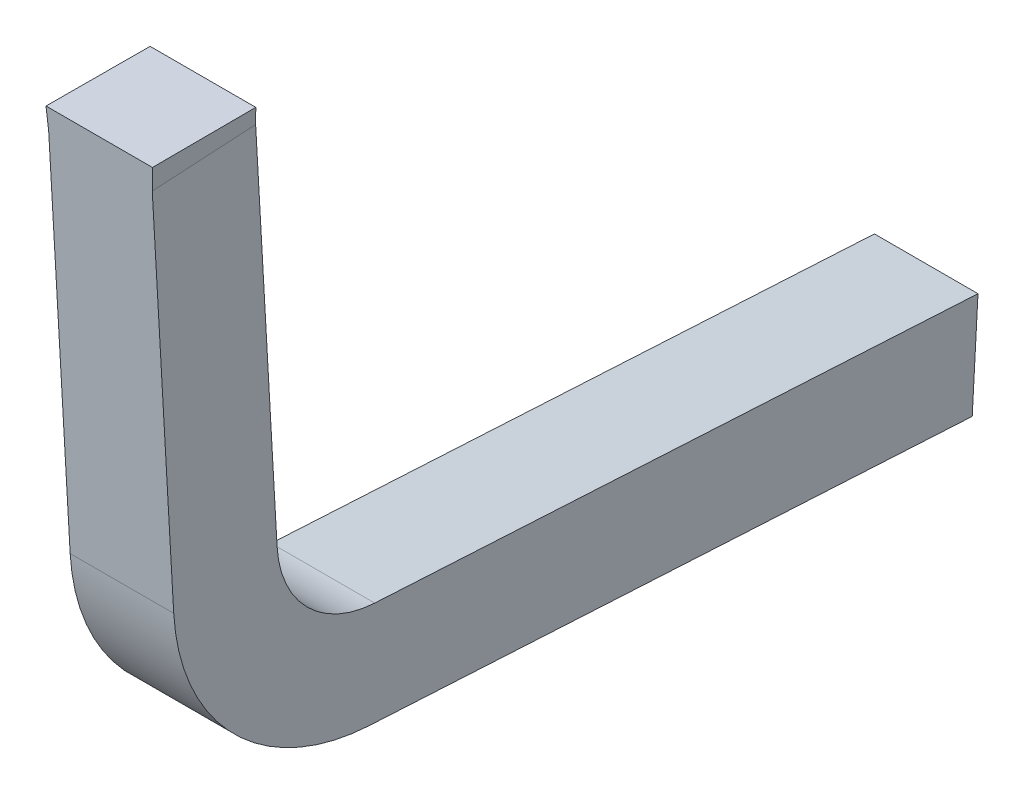
ISO-10303-21;
HEADER;
FILE_DESCRIPTION(('STEP AP214'),'2;1');
FILE_NAME('part.step','',(''),(''),'','','');
FILE_SCHEMA(('AUTOMOTIVE_DESIGN { 1 0 10303 214 1 1 1 1 }'));
ENDSEC;
DATA;
#1=APPLICATION_CONTEXT('core data for automotive mechanical design processes');
#2=APPLICATION_PROTOCOL_DEFINITION('international standard','automotive_design',2000,#1);
#3=PRODUCT_CONTEXT('',#1,'mechanical');
#4=PRODUCT('Part','Part','',(#3));
#5=PRODUCT_RELATED_PRODUCT_CATEGORY('part','',(#4));
#6=PRODUCT_DEFINITION_FORMATION('','',#4);
#7=PRODUCT_DEFINITION_CONTEXT('part definition',#1,'design');
#8=PRODUCT_DEFINITION('design','',#6,#7);
#9=PRODUCT_DEFINITION_SHAPE('','',#8);
#10=(LENGTH_UNIT() NAMED_UNIT(*) SI_UNIT(.MILLI.,.METRE.));
#11=(NAMED_UNIT(*) PLANE_ANGLE_UNIT() SI_UNIT($,.RADIAN.));
#12=(NAMED_UNIT(*) SI_UNIT($,.STERADIAN.) SOLID_ANGLE_UNIT());
#13=UNCERTAINTY_MEASURE_WITH_UNIT(LENGTH_MEASURE(1.E-05),#10,'distance_accuracy_value','');
#14=(GEOMETRIC_REPRESENTATION_CONTEXT(3) GLOBAL_UNCERTAINTY_ASSIGNED_CONTEXT((#13)) GLOBAL_UNIT_ASSIGNED_CONTEXT((#10,
#11,#12)) REPRESENTATION_CONTEXT('',''));
#15=CARTESIAN_POINT('',(0.,0.,0.));
#16=DIRECTION('',(0.,0.,1.));
#17=DIRECTION('',(1.,0.,0.));
#18=AXIS2_PLACEMENT_3D('',#15,#16,#17);
#19=CARTESIAN_POINT('',(-4.601406834182,-2.29897527843,-10.34781984343));
#20=DIRECTION('',(0.997785157857701,0.0664110878974701,0.003787632922693));
#21=DIRECTION('',(-0.0664115642747469,0.997792315129046,0.));
#22=AXIS2_PLACEMENT_3D('',#19,#20,#21);
#23=PLANE('',#22);
#24=DIRECTION('',(0.,-0.0569406083110753,0.998377567418842));
#25=VECTOR('',#24,1.);
#26=CARTESIAN_POINT('',(-4.6,-2.314349492935,-10.44885919008));
#27=LINE('',#26,#25);
#28=CARTESIAN_POINT('',(-4.6,-2.31434949293492,-10.4488591900814));
#29=VERTEX_POINT('',#28);
#30=CARTESIAN_POINT('',(-4.6,-2.32573761459728,-10.2491836765951));
#31=VERTEX_POINT('',#30);
#32=EDGE_CURVE('E98',#29,#31,#27,.T.);
#33=ORIENTED_EDGE('',*,*,#32,.T.);
#34=DIRECTION('',(0.0665190105147885,-0.996166318707982,-0.0568144938543089));
#35=VECTOR('',#34,1.);
#36=CARTESIAN_POINT('',(-4.602813668365,-2.28360106392498,-10.2467804967704));
#37=LINE('',#36,#35);
#38=CARTESIAN_POINT('',(-4.602813668365,-2.28360106392499,-10.2467804967704));
#39=VERTEX_POINT('',#38);
#40=EDGE_CURVE('E148',#39,#31,#37,.T.);
#41=ORIENTED_EDGE('',*,*,#40,.F.);
#42=DIRECTION('',(-0.0037960132015798,0.,0.999992795115932));
#43=VECTOR('',#42,1.);
#44=CARTESIAN_POINT('',(-4.602053226489,-2.283601063925,-10.4471055106));
#45=LINE('',#44,#43);
#46=CARTESIAN_POINT('',(-4.602053226489,-2.28360106392489,-10.4471055106019));
#47=VERTEX_POINT('',#46);
#48=EDGE_CURVE('E161',#47,#39,#45,.T.);
#49=ORIENTED_EDGE('',*,*,#48,.F.);
#50=DIRECTION('',(0.0665190105273533,-0.996166318707227,-0.0568144938528306));
#51=VECTOR('',#50,1.);
#52=CARTESIAN_POINT('',(-4.602053226489,-2.28360106392483,-10.4471055106029));
#53=LINE('',#52,#51);
#54=EDGE_CURVE('E103',#47,#29,#53,.T.);
#55=ORIENTED_EDGE('',*,*,#54,.T.);
#56=EDGE_LOOP('',(#33,#41,#49,#55));
#57=FACE_BOUND('',#56,.T.);
#58=ADVANCED_FACE('F17',(#57),#23,.F.);
#59=CARTESIAN_POINT('',(-4.5,-2.283601063925,-10.34694300368));
#60=DIRECTION('',(0.,1.,0.));
#61=DIRECTION('',(0.,0.,1.));
#62=AXIS2_PLACEMENT_3D('',#59,#60,#61);
#63=PLANE('',#62);
#64=DIRECTION('',(1.,0.,0.));
#65=VECTOR('',#64,1.);
#66=CARTESIAN_POINT('',(-4.5,-2.28360106392498,-10.2467804967704));
#67=LINE('',#66,#65);
#68=CARTESIAN_POINT('',(-4.39718633163475,-2.283601063925,-10.2467804967704));
#69=VERTEX_POINT('',#68);
#70=EDGE_CURVE('E154',#69,#39,#67,.F.);
#71=ORIENTED_EDGE('',*,*,#70,.F.);
#72=DIRECTION('',(0.00379601320426427,-1.7968426456006E-13,0.999992795115921));
#73=VECTOR('',#72,1.);
#74=CARTESIAN_POINT('',(-4.3979467735108,-2.28360106392501,-10.4471055106));
#75=LINE('',#74,#73);
#76=CARTESIAN_POINT('',(-4.39794677351087,-2.28360106392495,-10.447105510601));
#77=VERTEX_POINT('',#76);
#78=EDGE_CURVE('E119',#77,#69,#75,.T.);
#79=ORIENTED_EDGE('',*,*,#78,.F.);
#80=DIRECTION('',(1.,0.,0.));
#81=VECTOR('',#80,1.);
#82=CARTESIAN_POINT('',(-4.5,-2.28360106392483,-10.4471055106029));
#83=LINE('',#82,#81);
#84=EDGE_CURVE('E125',#77,#47,#83,.F.);
#85=ORIENTED_EDGE('',*,*,#84,.T.);
#86=ORIENTED_EDGE('',*,*,#48,.T.);
#87=EDGE_LOOP('',(#71,#79,#85,#86));
#88=FACE_BOUND('',#87,.T.);
#89=ADVANCED_FACE('F243',(#88),#63,.T.);
#90=CARTESIAN_POINT('',(-4.6,-2.909472777839,-11.05227927458));
#91=DIRECTION('',(1.,0.,0.));
#92=DIRECTION('',(0.,0.,-1.));
#93=AXIS2_PLACEMENT_3D('',#90,#91,#92);
#94=PLANE('',#93);
#95=CARTESIAN_POINT('',(-4.6,-3.03,-10.69));
#96=DIRECTION('',(-1.,0.,0.));
#97=DIRECTION('',(0.,0.,1.));
#98=AXIS2_PLACEMENT_3D('',#95,#96,#97);
#99=CIRCLE('',#98,0.4);
#100=CARTESIAN_POINT('',(-4.6,-3.05277624331319,-10.2906489730306));
#101=VERTEX_POINT('',#100);
#102=CARTESIAN_POINT('',(-4.6,-3.42937693582933,-10.6676826720305));
#103=VERTEX_POINT('',#102);
#104=EDGE_CURVE('E142',#101,#103,#99,.F.);
#105=ORIENTED_EDGE('',*,*,#104,.F.);
#106=DIRECTION('',(0.,-0.998377567418718,-0.056940608313261));
#107=VECTOR('',#106,1.);
#108=CARTESIAN_POINT('',(-4.6,-2.668188653621,-10.2687147349));
#109=LINE('',#108,#107);
#110=EDGE_CURVE('E145',#31,#101,#109,.T.);
#111=ORIENTED_EDGE('',*,*,#110,.F.);
#112=ORIENTED_EDGE('',*,*,#32,.F.);
#113=DIRECTION('',(0.,-0.998377567418801,-0.0569406083117901));
#114=VECTOR('',#113,1.);
#115=CARTESIAN_POINT('',(-4.6,-2.662494592804,-10.46871499856));
#116=LINE('',#115,#114);
#117=CARTESIAN_POINT('',(-4.6,-3.04138812167726,-10.4903244865168));
#118=VERTEX_POINT('',#117);
#119=EDGE_CURVE('E92',#29,#118,#116,.T.);
#120=ORIENTED_EDGE('',*,*,#119,.T.);
#121=CARTESIAN_POINT('',(-4.6,-3.03,-10.69));
#122=DIRECTION('',(-1.,0.,0.));
#123=DIRECTION('',(0.,0.,1.));
#124=AXIS2_PLACEMENT_3D('',#121,#122,#123);
#125=CIRCLE('',#124,0.2);
#126=CARTESIAN_POINT('',(-4.6,-3.22968846791482,-10.6788413360177));
#127=VERTEX_POINT('',#126);
#128=EDGE_CURVE('E20',#118,#127,#125,.F.);
#129=ORIENTED_EDGE('',*,*,#128,.T.);
#130=DIRECTION('',(0.,0.0557933199228295,0.998442339572991));
#131=VECTOR('',#130,1.);
#132=CARTESIAN_POINT('',(-4.6,-3.262244863925,-11.26145022621));
#133=LINE('',#132,#131);
#134=CARTESIAN_POINT('',(-4.6,-3.29480125993501,-11.8440591164004));
#135=VERTEX_POINT('',#134);
#136=EDGE_CURVE('E111',#135,#127,#133,.T.);
#137=ORIENTED_EDGE('',*,*,#136,.F.);
#138=DIRECTION('',(0.,-0.998442339574031,0.0557933199042218));
#139=VECTOR('',#138,1.);
#140=CARTESIAN_POINT('',(-4.6,-3.394645493892,-11.83847978441));
#141=LINE('',#140,#139);
#142=CARTESIAN_POINT('',(-4.6,-3.49448972784906,-11.8329004524196));
#143=VERTEX_POINT('',#142);
#144=EDGE_CURVE('E135',#135,#143,#141,.T.);
#145=ORIENTED_EDGE('',*,*,#144,.T.);
#146=DIRECTION('',(0.,0.055793319922371,0.998442339573017));
#147=VECTOR('',#146,1.);
#148=CARTESIAN_POINT('',(-4.6,-3.461933331839,-11.25029156222));
#149=LINE('',#148,#147);
#150=EDGE_CURVE('E140',#143,#103,#149,.T.);
#151=ORIENTED_EDGE('',*,*,#150,.T.);
#152=EDGE_LOOP('',(#105,#111,#112,#120,#129,#137,#145,#151));
#153=FACE_BOUND('',#152,.T.);
#154=ADVANCED_FACE('F95',(#153),#94,.F.);
#155=CARTESIAN_POINT('',(-4.5,-3.262244863925,-11.26145022621));
#156=DIRECTION('',(0.,0.998442339572991,-0.0557933199228295));
#157=DIRECTION('',(0.,0.0557933199228295,0.998442339572991));
#158=AXIS2_PLACEMENT_3D('',#155,#156,#157);
#159=PLANE('',#158);
#160=DIRECTION('',(0.,0.055793319922887,0.998442339572988));
#161=VECTOR('',#160,1.);
#162=CARTESIAN_POINT('',(-4.4,-3.294801259935,-11.8440591164));
#163=LINE('',#162,#161);
#164=CARTESIAN_POINT('',(-4.4,-3.29480125993501,-11.8440591164001));
#165=VERTEX_POINT('',#164);
#166=CARTESIAN_POINT('',(-4.4,-3.2296884679148,-10.6788413360177));
#167=VERTEX_POINT('',#166);
#168=EDGE_CURVE('E129',#165,#167,#163,.T.);
#169=ORIENTED_EDGE('',*,*,#168,.F.);
#170=DIRECTION('',(1.,0.,0.));
#171=VECTOR('',#170,1.);
#172=CARTESIAN_POINT('',(-4.5,-3.29480125993502,-11.8440591164004));
#173=LINE('',#172,#171);
#174=EDGE_CURVE('E126',#165,#135,#173,.F.);
#175=ORIENTED_EDGE('',*,*,#174,.T.);
#176=ORIENTED_EDGE('',*,*,#136,.T.);
#177=DIRECTION('',(-1.,0.,0.));
#178=VECTOR('',#177,1.);
#179=CARTESIAN_POINT('',(-4.396,-3.22968846791485,-10.67884133602));
#180=LINE('',#179,#178);
#181=EDGE_CURVE('E110',#127,#167,#180,.F.);
#182=ORIENTED_EDGE('',*,*,#181,.T.);
#183=EDGE_LOOP('',(#169,#175,#176,#182));
#184=FACE_BOUND('',#183,.T.);
#185=ADVANCED_FACE('F234',(#184),#159,.T.);
#186=CARTESIAN_POINT('',(-4.396,-3.03,-10.69));
#187=DIRECTION('',(-1.,0.,0.));
#188=DIRECTION('',(0.,0.,1.));
#189=AXIS2_PLACEMENT_3D('',#186,#187,#188);
#190=CYLINDRICAL_SURFACE('',#189,0.2);
#191=ORIENTED_EDGE('',*,*,#128,.F.);
#192=DIRECTION('',(1.,0.,0.));
#193=VECTOR('',#192,1.);
#194=CARTESIAN_POINT('',(-4.5,-3.04138812169214,-10.4903244865176));
#195=LINE('',#194,#193);
#196=CARTESIAN_POINT('',(-4.4,-3.04138812167779,-10.490324486518));
#197=VERTEX_POINT('',#196);
#198=EDGE_CURVE('E102',#118,#197,#195,.T.);
#199=ORIENTED_EDGE('',*,*,#198,.T.);
#200=CARTESIAN_POINT('',(-4.4,-3.03,-10.69));
#201=DIRECTION('',(-1.,0.,0.));
#202=DIRECTION('',(0.,0.,1.));
#203=AXIS2_PLACEMENT_3D('',#200,#201,#202);
#204=CIRCLE('',#203,0.2);
#205=EDGE_CURVE('E185',#167,#197,#204,.T.);
#206=ORIENTED_EDGE('',*,*,#205,.F.);
#207=ORIENTED_EDGE('',*,*,#181,.F.);
#208=EDGE_LOOP('',(#191,#199,#206,#207));
#209=FACE_BOUND('',#208,.T.);
#210=ADVANCED_FACE('F107',(#209),#190,.F.);
#211=CARTESIAN_POINT('',(-4.5,-2.662494592804,-10.46871499856));
#212=DIRECTION('',(0.,-0.0569406083117901,0.998377567418801));
#213=DIRECTION('',(0.,-0.998377567418801,-0.0569406083117901));
#214=AXIS2_PLACEMENT_3D('',#211,#212,#213);
#215=PLANE('',#214);
#216=DIRECTION('',(0.,0.998377567418456,0.0569406083178453));
#217=VECTOR('',#216,1.);
#218=CARTESIAN_POINT('',(-4.4,-3.041388121692,-10.49032448652));
#219=LINE('',#218,#217);
#220=CARTESIAN_POINT('',(-4.39999999999992,-2.314349492934,-10.44885919008));
#221=VERTEX_POINT('',#220);
#222=EDGE_CURVE('E114',#197,#221,#219,.T.);
#223=ORIENTED_EDGE('',*,*,#222,.F.);
#224=ORIENTED_EDGE('',*,*,#198,.F.);
#225=ORIENTED_EDGE('',*,*,#119,.F.);
#226=ORIENTED_EDGE('',*,*,#54,.F.);
#227=ORIENTED_EDGE('',*,*,#84,.F.);
#228=DIRECTION('',(0.0665190105284045,0.996166318705549,0.0568144938810225));
#229=VECTOR('',#228,1.);
#230=CARTESIAN_POINT('',(-4.39999999999977,-2.31434949293401,-10.44885919008));
#231=LINE('',#230,#229);
#232=EDGE_CURVE('E116',#221,#77,#231,.T.);
#233=ORIENTED_EDGE('',*,*,#232,.F.);
#234=EDGE_LOOP('',(#223,#224,#225,#226,#227,#233));
#235=FACE_BOUND('',#234,.T.);
#236=ADVANCED_FACE('F112',(#235),#215,.F.);
#237=CARTESIAN_POINT('',(-4.398593165817,-2.298975278429,-10.34781984343));
#238=DIRECTION('',(0.9977851578563,-0.06641108791847,-0.003787632923708));
#239=DIRECTION('',(0.0664115642957472,0.997792315127648,0.));
#240=AXIS2_PLACEMENT_3D('',#237,#238,#239);
#241=PLANE('',#240);
#242=ORIENTED_EDGE('',*,*,#232,.T.);
#243=ORIENTED_EDGE('',*,*,#78,.T.);
#244=DIRECTION('',(0.0665190105179218,0.996166318707772,0.0568144938543193));
#245=VECTOR('',#244,1.);
#246=CARTESIAN_POINT('',(-4.4,-2.32573761459528,-10.249183676595));
#247=LINE('',#246,#245);
#248=CARTESIAN_POINT('',(-4.4,-2.32573761459509,-10.2491836765983));
#249=VERTEX_POINT('',#248);
#250=EDGE_CURVE('E147',#249,#69,#247,.T.);
#251=ORIENTED_EDGE('',*,*,#250,.F.);
#252=DIRECTION('',(0.,-0.0569406083060912,0.998377567419126));
#253=VECTOR('',#252,1.);
#254=CARTESIAN_POINT('',(-4.4,-2.314349492934,-10.44885919008));
#255=LINE('',#254,#253);
#256=EDGE_CURVE('E200',#221,#249,#255,.T.);
#257=ORIENTED_EDGE('',*,*,#256,.F.);
#258=EDGE_LOOP('',(#242,#243,#251,#257));
#259=FACE_BOUND('',#258,.T.);
#260=ADVANCED_FACE('F258',(#259),#241,.T.);
#261=CARTESIAN_POINT('',(-4.5,-2.668188653621,-10.2687147349));
#262=DIRECTION('',(0.,-0.056940608313261,0.998377567418718));
#263=DIRECTION('',(0.,-0.998377567418718,-0.056940608313261));
#264=AXIS2_PLACEMENT_3D('',#261,#262,#263);
#265=PLANE('',#264);
#266=ORIENTED_EDGE('',*,*,#250,.T.);
#267=ORIENTED_EDGE('',*,*,#70,.T.);
#268=ORIENTED_EDGE('',*,*,#40,.T.);
#269=ORIENTED_EDGE('',*,*,#110,.T.);
#270=DIRECTION('',(-1.,0.,0.));
#271=VECTOR('',#270,1.);
#272=CARTESIAN_POINT('',(-4.396,-3.05277624330094,-10.2906489730311));
#273=LINE('',#272,#271);
#274=CARTESIAN_POINT('',(-4.4,-3.05277624331214,-10.2906489730312));
#275=VERTEX_POINT('',#274);
#276=EDGE_CURVE('E157',#275,#101,#273,.T.);
#277=ORIENTED_EDGE('',*,*,#276,.F.);
#278=DIRECTION('',(0.,-0.998377567419005,-0.0569406083082185));
#279=VECTOR('',#278,1.);
#280=CARTESIAN_POINT('',(-4.4,-2.325737614595,-10.2491836766));
#281=LINE('',#280,#279);
#282=EDGE_CURVE('E184',#249,#275,#281,.T.);
#283=ORIENTED_EDGE('',*,*,#282,.F.);
#284=EDGE_LOOP('',(#266,#267,#268,#269,#277,#283));
#285=FACE_BOUND('',#284,.T.);
#286=ADVANCED_FACE('F227',(#285),#265,.T.);
#287=CARTESIAN_POINT('',(-4.396,-3.03,-10.69));
#288=DIRECTION('',(-1.,0.,0.));
#289=DIRECTION('',(0.,0.,1.));
#290=AXIS2_PLACEMENT_3D('',#287,#288,#289);
#291=CYLINDRICAL_SURFACE('',#290,0.4);
#292=DIRECTION('',(1.,0.,0.));
#293=VECTOR('',#292,1.);
#294=CARTESIAN_POINT('',(-4.5,-3.4293769358293,-10.66768267203));
#295=LINE('',#294,#293);
#296=CARTESIAN_POINT('',(-4.4,-3.42937693582946,-10.6676826720306));
#297=VERTEX_POINT('',#296);
#298=EDGE_CURVE('E137',#103,#297,#295,.T.);
#299=ORIENTED_EDGE('',*,*,#298,.T.);
#300=CARTESIAN_POINT('',(-4.4,-3.03,-10.69));
#301=DIRECTION('',(-1.,0.,0.));
#302=DIRECTION('',(0.,0.,1.));
#303=AXIS2_PLACEMENT_3D('',#300,#301,#302);
#304=CIRCLE('',#303,0.4);
#305=EDGE_CURVE('E181',#275,#297,#304,.F.);
#306=ORIENTED_EDGE('',*,*,#305,.F.);
#307=ORIENTED_EDGE('',*,*,#276,.T.);
#308=ORIENTED_EDGE('',*,*,#104,.T.);
#309=EDGE_LOOP('',(#299,#306,#307,#308));
#310=FACE_BOUND('',#309,.T.);
#311=ADVANCED_FACE('F220',(#310),#291,.T.);
#312=CARTESIAN_POINT('',(-4.5,-3.461933331839,-11.25029156222));
#313=DIRECTION('',(0.,0.998442339573017,-0.055793319922371));
#314=DIRECTION('',(0.,0.055793319922371,0.998442339573017));
#315=AXIS2_PLACEMENT_3D('',#312,#313,#314);
#316=PLANE('',#315);
#317=ORIENTED_EDGE('',*,*,#298,.F.);
#318=ORIENTED_EDGE('',*,*,#150,.F.);
#319=DIRECTION('',(1.,0.,0.));
#320=VECTOR('',#319,1.);
#321=CARTESIAN_POINT('',(-4.5,-3.49448972784898,-11.8329004524196));
#322=LINE('',#321,#320);
#323=CARTESIAN_POINT('',(-4.4,-3.49448972784899,-11.8329004524199));
#324=VERTEX_POINT('',#323);
#325=EDGE_CURVE('E35',#143,#324,#322,.T.);
#326=ORIENTED_EDGE('',*,*,#325,.T.);
#327=DIRECTION('',(0.,-0.0557933199219327,-0.998442339573042));
#328=VECTOR('',#327,1.);
#329=CARTESIAN_POINT('',(-4.4,-3.429376935829,-10.66768267202));
#330=LINE('',#329,#328);
#331=EDGE_CURVE('E26',#297,#324,#330,.T.);
#332=ORIENTED_EDGE('',*,*,#331,.F.);
#333=EDGE_LOOP('',(#317,#318,#326,#332));
#334=FACE_BOUND('',#333,.T.);
#335=ADVANCED_FACE('F222',(#334),#316,.F.);
#336=CARTESIAN_POINT('',(-4.5,-3.394645493892,-11.83847978441));
#337=DIRECTION('',(0.,0.0557933199042218,0.998442339574031));
#338=DIRECTION('',(0.,-0.998442339574031,0.0557933199042218));
#339=AXIS2_PLACEMENT_3D('',#336,#337,#338);
#340=PLANE('',#339);
#341=DIRECTION('',(0.,0.998442339574254,-0.0557933199002383));
#342=VECTOR('',#341,1.);
#343=CARTESIAN_POINT('',(-4.4,-3.494489727849,-11.83290045242));
#344=LINE('',#343,#342);
#345=EDGE_CURVE('E11',#324,#165,#344,.T.);
#346=ORIENTED_EDGE('',*,*,#345,.F.);
#347=ORIENTED_EDGE('',*,*,#325,.F.);
#348=ORIENTED_EDGE('',*,*,#144,.F.);
#349=ORIENTED_EDGE('',*,*,#174,.F.);
#350=EDGE_LOOP('',(#346,#347,#348,#349));
#351=FACE_BOUND('',#350,.T.);
#352=ADVANCED_FACE('F230',(#351),#340,.F.);
#353=CARTESIAN_POINT('',(-4.4,-2.909472777838,-11.05227927458));
#354=DIRECTION('',(1.,0.,0.));
#355=DIRECTION('',(0.,0.,-1.));
#356=AXIS2_PLACEMENT_3D('',#353,#354,#355);
#357=PLANE('',#356);
#358=ORIENTED_EDGE('',*,*,#331,.T.);
#359=ORIENTED_EDGE('',*,*,#345,.T.);
#360=ORIENTED_EDGE('',*,*,#168,.T.);
#361=ORIENTED_EDGE('',*,*,#205,.T.);
#362=ORIENTED_EDGE('',*,*,#222,.T.);
#363=ORIENTED_EDGE('',*,*,#256,.T.);
#364=ORIENTED_EDGE('',*,*,#282,.T.);
#365=ORIENTED_EDGE('',*,*,#305,.T.);
#366=EDGE_LOOP('',(#358,#359,#360,#361,#362,#363,#364,#365));
#367=FACE_BOUND('',#366,.T.);
#368=ADVANCED_FACE('F224',(#367),#357,.T.);
#369=CLOSED_SHELL('',(#58,#89,#154,#185,#210,#236,#260,#286,#311,#335,#352,#368));
#370=MANIFOLD_SOLID_BREP('B1',#369);
#371=ADVANCED_BREP_SHAPE_REPRESENTATION('',(#18,#370),#14);
#372=SHAPE_DEFINITION_REPRESENTATION(#9,#371);
ENDSEC;
END-ISO-10303-21;
